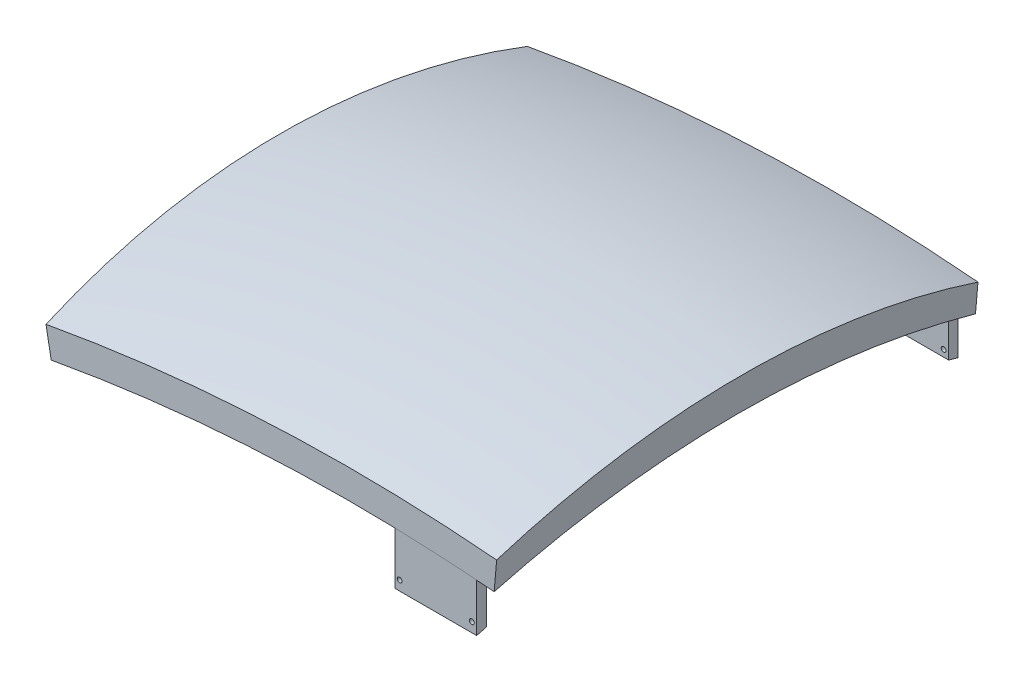
ISO-10303-21;
HEADER;
FILE_DESCRIPTION(('STEP AP214'),'2;1');
FILE_NAME('part.step','',(''),(''),'','','');
FILE_SCHEMA(('AUTOMOTIVE_DESIGN { 1 0 10303 214 1 1 1 1 }'));
ENDSEC;
DATA;
#1=APPLICATION_CONTEXT('core data for automotive mechanical design processes');
#2=APPLICATION_PROTOCOL_DEFINITION('international standard','automotive_design',2000,#1);
#3=PRODUCT_CONTEXT('',#1,'mechanical');
#4=PRODUCT('Part','Part','',(#3));
#5=PRODUCT_RELATED_PRODUCT_CATEGORY('part','',(#4));
#6=PRODUCT_DEFINITION_FORMATION('','',#4);
#7=PRODUCT_DEFINITION_CONTEXT('part definition',#1,'design');
#8=PRODUCT_DEFINITION('design','',#6,#7);
#9=PRODUCT_DEFINITION_SHAPE('','',#8);
#10=(LENGTH_UNIT() NAMED_UNIT(*) SI_UNIT(.MILLI.,.METRE.));
#11=(NAMED_UNIT(*) PLANE_ANGLE_UNIT() SI_UNIT($,.RADIAN.));
#12=(NAMED_UNIT(*) SI_UNIT($,.STERADIAN.) SOLID_ANGLE_UNIT());
#13=UNCERTAINTY_MEASURE_WITH_UNIT(LENGTH_MEASURE(1.E-05),#10,'distance_accuracy_value','');
#14=(GEOMETRIC_REPRESENTATION_CONTEXT(3) GLOBAL_UNCERTAINTY_ASSIGNED_CONTEXT((#13)) GLOBAL_UNIT_ASSIGNED_CONTEXT((#10,
#11,#12)) REPRESENTATION_CONTEXT('',''));
#15=CARTESIAN_POINT('',(0.,0.,0.));
#16=DIRECTION('',(0.,0.,1.));
#17=DIRECTION('',(1.,0.,0.));
#18=AXIS2_PLACEMENT_3D('',#15,#16,#17);
#19=CARTESIAN_POINT('',(-176.364898911844,394.628323453964,-1000.));
#20=CARTESIAN_POINT('',(-174.245064249706,418.997003403984,-919.073528480852));
#21=CARTESIAN_POINT('',(-172.640831351024,437.43855395933,-836.350074725818));
#22=CARTESIAN_POINT('',(-170.497967391497,462.071968532359,-669.083579056265));
#23=CARTESIAN_POINT('',(-169.959360397827,468.263555862461,-584.542116051659));
#24=CARTESIAN_POINT('',(-169.959360397827,468.263555862461,-415.457883948342));
#25=CARTESIAN_POINT('',(-170.497967390338,462.071968532186,-330.916420936693));
#26=CARTESIAN_POINT('',(-172.640831352182,437.438553959504,-163.649925281226));
#27=CARTESIAN_POINT('',(-174.245064251245,418.997003390395,-80.9264715179744));
#28=CARTESIAN_POINT('',(-176.364898911844,394.628323453964,0.));
#29=CARTESIAN_POINT('',(-176.364898911844,285.854271513005,-1000.));
#30=CARTESIAN_POINT('',(-174.245064255569,310.222951463068,-919.073528480711));
#31=CARTESIAN_POINT('',(-172.640831351024,328.664502018372,-836.350074725818));
#32=CARTESIAN_POINT('',(-170.497967391497,353.297916591401,-669.083579056265));
#33=CARTESIAN_POINT('',(-169.959360397827,359.489503921502,-584.542116051659));
#34=CARTESIAN_POINT('',(-169.959360397827,359.489503921502,-415.457883948342));
#35=CARTESIAN_POINT('',(-170.497967390338,353.297916591227,-330.916420936693));
#36=CARTESIAN_POINT('',(-172.640831352182,328.664502018545,-163.649925281226));
#37=CARTESIAN_POINT('',(-174.245064251245,310.222951449437,-80.9264715179745));
#38=CARTESIAN_POINT('',(-176.364898911844,285.854271513005,0.));
#39=B_SPLINE_SURFACE_WITH_KNOTS('',1,3,((#19,#20,#21,#22,#23,#24,#25,#26,#27,#28),(#29,#30,#31,
#32,#33,#34,#35,#36,#37,#38)),.UNSPECIFIED.,.F.,.F.,.F.,(2,2),(4,2,2,2,4),(0.,1.),(0.,0.25,0.5,
0.75,1.),.UNSPECIFIED.);
#40=CARTESIAN_POINT('',(-176.364898911844,285.854271513005,-1000.));
#41=CARTESIAN_POINT('',(-174.245064255569,310.222951463068,-919.073528480711));
#42=CARTESIAN_POINT('',(-172.640831351024,328.664502018372,-836.350074725818));
#43=CARTESIAN_POINT('',(-170.497967391497,353.297916591401,-669.083579056265));
#44=CARTESIAN_POINT('',(-169.959360397827,359.489503921502,-584.542116051659));
#45=CARTESIAN_POINT('',(-169.959360397827,359.489503921502,-415.457883948342));
#46=CARTESIAN_POINT('',(-170.497967390338,353.297916591227,-330.916420936693));
#47=CARTESIAN_POINT('',(-172.640831352182,328.664502018545,-163.649925281226));
#48=CARTESIAN_POINT('',(-174.245064251245,310.222951449437,-80.9264715179745));
#49=CARTESIAN_POINT('',(-176.364898911844,285.854271513005,0.));
#50=B_SPLINE_CURVE_WITH_KNOTS('',3,(#40,#41,#42,#43,#44,#45,#46,#47,#48,#49),.UNSPECIFIED.,.F.,
.F.,(4,2,2,2,4),(0.,0.25,0.5,0.75,1.),.UNSPECIFIED.);
#51=CARTESIAN_POINT('',(-176.364898911844,285.854271513005,-1000.));
#52=VERTEX_POINT('',#51);
#53=CARTESIAN_POINT('',(-175.852418351349,291.745520963929,-979.999999999994));
#54=VERTEX_POINT('',#53);
#55=EDGE_CURVE('E219',#52,#54,#50,.T.);
#56=DIRECTION('',(0.,-1.,0.));
#57=VECTOR('',#56,1.);
#58=CARTESIAN_POINT('',(-175.85241835074,346.132546934406,-980.000000000002));
#59=LINE('',#58,#57);
#60=CARTESIAN_POINT('',(-175.852418350196,394.615618463547,-980.000000000002));
#61=VERTEX_POINT('',#60);
#62=EDGE_CURVE('E220',#54,#61,#59,.F.);
#63=CARTESIAN_POINT('',(-175.852418350469,394.615618463553,-20.));
#64=CARTESIAN_POINT('',(-175.633649908094,397.130639264421,-28.7312953353162));
#65=CARTESIAN_POINT('',(-175.420856523349,399.576923444562,-37.4825373964243));
#66=CARTESIAN_POINT('',(-175.007270495764,404.331458464085,-55.0223803952738));
#67=CARTESIAN_POINT('',(-174.806477418497,406.639714300281,-63.8109799682703));
#68=CARTESIAN_POINT('',(-174.416931396696,411.117761702714,-81.4234274319611));
#69=CARTESIAN_POINT('',(-174.228178166723,413.287556551584,-90.2472744817342));
#70=CARTESIAN_POINT('',(-173.862751713488,417.488245043917,-107.92810932455));
#71=CARTESIAN_POINT('',(-173.686078348922,419.519140312178,-116.78509672865));
#72=CARTESIAN_POINT('',(-173.344849796396,423.441612147967,-134.530225449709));
#73=CARTESIAN_POINT('',(-173.180294770857,425.333186848197,-143.418367182555));
#74=CARTESIAN_POINT('',(-172.863346359201,428.976538350666,-161.223583009343));
#75=CARTESIAN_POINT('',(-172.710953119857,430.728313465744,-170.140657451107));
#76=CARTESIAN_POINT('',(-172.418369981168,434.091608591467,-188.001647931472));
#77=CARTESIAN_POINT('',(-172.278180376481,435.703125215566,-196.945564612788));
#78=CARTESIAN_POINT('',(-172.010045767962,438.785443326145,-214.858104223181));
#79=CARTESIAN_POINT('',(-171.882101211631,440.256239669947,-223.826728042874));
#80=CARTESIAN_POINT('',(-171.599913016004,443.500254976911,-244.631815034944));
#81=CARTESIAN_POINT('',(-171.450183189959,445.221616593362,-256.476464140352));
#82=CARTESIAN_POINT('',(-171.172102769806,448.418499365325,-280.19954475529));
#83=CARTESIAN_POINT('',(-171.043752976758,449.894011309434,-292.077977513662));
#84=CARTESIAN_POINT('',(-170.80846524885,452.598846602958,-315.86316896709));
#85=CARTESIAN_POINT('',(-170.701527503256,453.828167776245,-327.769927911585));
#86=CARTESIAN_POINT('',(-170.50910179039,456.040198549553,-351.606248608816));
#87=CARTESIAN_POINT('',(-170.423613376701,457.022913282118,-363.535809881765));
#88=CARTESIAN_POINT('',(-170.274086018133,458.741751258213,-387.41759736608));
#89=CARTESIAN_POINT('',(-170.21005562138,459.477776229178,-399.369830706989));
#90=CARTESIAN_POINT('',(-170.103524359393,460.702329772858,-423.286992414682));
#91=CARTESIAN_POINT('',(-170.061023407674,461.190859339774,-435.251920730276));
#92=CARTESIAN_POINT('',(-169.997582004924,461.920081638696,-459.189998295791));
#93=CARTESIAN_POINT('',(-169.97664248938,462.1607636173,-471.163147879859));
#94=CARTESIAN_POINT('',(-169.9614305314,462.335610929683,-489.125061834476));
#95=CARTESIAN_POINT('',(-169.959059728503,462.362860675007,-495.113042086699));
#96=CARTESIAN_POINT('',(-169.959721965668,462.355248912441,-507.088968680493));
#97=CARTESIAN_POINT('',(-169.962755024179,462.320387192501,-513.076915021877));
#98=CARTESIAN_POINT('',(-169.983385295761,462.083261072045,-534.62341455575));
#99=CARTESIAN_POINT('',(-170.016513112895,461.702483600511,-550.180403000621));
#100=CARTESIAN_POINT('',(-170.119165491115,460.522540372856,-581.280495529891));
#101=CARTESIAN_POINT('',(-170.188695570766,459.723311179656,-596.823597151074));
#102=CARTESIAN_POINT('',(-170.364092875445,457.707116426226,-627.884272853659));
#103=CARTESIAN_POINT('',(-170.469964245387,456.490103215563,-643.401843820218));
#104=CARTESIAN_POINT('',(-170.717982682389,453.6390081718,-674.39972826961));
#105=CARTESIAN_POINT('',(-170.860132534649,452.004894316728,-689.880038799706));
#106=CARTESIAN_POINT('',(-171.100504138609,449.241596321608,-713.062938336732));
#107=CARTESIAN_POINT('',(-171.185155617635,448.268439688238,-720.78455671707));
#108=CARTESIAN_POINT('',(-171.363499099536,446.218157125475,-736.213872974977));
#109=CARTESIAN_POINT('',(-171.457191102378,445.141031196451,-743.921570852596));
#110=CARTESIAN_POINT('',(-171.752166931321,441.74993242435,-767.049160336694));
#111=CARTESIAN_POINT('',(-171.96706747798,439.279493515605,-782.446233800843));
#112=CARTESIAN_POINT('',(-172.432902272435,433.92453755953,-813.166889478322));
#113=CARTESIAN_POINT('',(-172.683835274314,431.040034829533,-828.490474213792));
#114=CARTESIAN_POINT('',(-173.221509234822,424.859423134112,-859.052773873231));
#115=CARTESIAN_POINT('',(-173.5082478141,421.563341518912,-874.291494366374));
#116=CARTESIAN_POINT('',(-174.117298923732,414.562161821589,-904.672367575334));
#117=CARTESIAN_POINT('',(-174.439607923776,410.85710432971,-919.81452971692));
#118=CARTESIAN_POINT('',(-175.119561471268,403.040603507002,-949.990672281036));
#119=CARTESIAN_POINT('',(-175.477201368815,398.929213653578,-965.024666660867));
#120=CARTESIAN_POINT('',(-175.852418350196,394.615618463546,-980.000000000002));
#121=B_SPLINE_CURVE_WITH_KNOTS('',3,(#63,#64,#65,#66,#67,#68,#69,#70,#71,#72,#73,#74,#75,#76,
#77,#78,#79,#80,#81,#82,#83,#84,#85,#86,#87,#88,#89,#90,#91,#92,#93,#94,#95,#96,#97,#98,#99,
#100,#101,#102,#103,#104,#105,#106,#107,#108,#109,#110,#111,#112,#113,#114,#115,#116,#117,#118,
#119,#120),.UNSPECIFIED.,.F.,.F.,(4,2,2,2,2,2,2,2,2,2,2,2,2,2,2,2,2,2,2,2,2,2,2,2,2,2,2,2,4),
(0.,27.2665127558033,54.5320378283226,81.7969162494932,109.061475681148,136.32640047032,
163.591654254512,190.857566176607,218.124474161715,254.03180869546,289.940488289235,
325.849485272641,361.75773483106,397.680272024188,433.602664913344,469.526616307095,
487.490455774942,505.454356571986,552.133113364645,598.818948684264,645.510110535511,
692.20485807516,715.553724726998,738.902591296155,785.682823121186,832.461437787549,
879.236945575881,926.007815132002,972.772537350092),.UNSPECIFIED.);
#122=CARTESIAN_POINT('',(-175.852418350469,394.615618463554,-20.));
#123=VERTEX_POINT('',#122);
#124=EDGE_CURVE('E126',#123,#61,#121,.T.);
#125=DIRECTION('',(0.,-1.,0.));
#126=VECTOR('',#125,1.);
#127=CARTESIAN_POINT('',(-175.852418350469,346.132546931618,-20.));
#128=LINE('',#127,#126);
#129=CARTESIAN_POINT('',(-175.852418350469,291.745520961139,-19.9999999999999));
#130=VERTEX_POINT('',#129);
#131=EDGE_CURVE('E125',#130,#123,#128,.F.);
#132=CARTESIAN_POINT('',(-176.364898911844,285.854271513005,0.));
#133=VERTEX_POINT('',#132);
#134=EDGE_CURVE('E226',#130,#133,#50,.T.);
#135=DIRECTION('',(0.,-1.,0.));
#136=VECTOR('',#135,1.);
#137=CARTESIAN_POINT('',(-176.364898911844,285.854271513005,0.));
#138=LINE('',#137,#136);
#139=CARTESIAN_POINT('',(-176.364898911844,394.628323453964,0.));
#140=VERTEX_POINT('',#139);
#141=EDGE_CURVE('E229',#140,#133,#138,.T.);
#142=CARTESIAN_POINT('',(-176.364898911844,394.628323453964,-1000.));
#143=CARTESIAN_POINT('',(-174.245064249706,418.997003403984,-919.073528480852));
#144=CARTESIAN_POINT('',(-172.640831351024,437.43855395933,-836.350074725818));
#145=CARTESIAN_POINT('',(-170.497967391497,462.071968532359,-669.083579056265));
#146=CARTESIAN_POINT('',(-169.959360397827,468.263555862461,-584.542116051659));
#147=CARTESIAN_POINT('',(-169.959360397827,468.263555862461,-415.457883948342));
#148=CARTESIAN_POINT('',(-170.497967390339,462.071968532186,-330.916420936693));
#149=CARTESIAN_POINT('',(-172.640831352182,437.438553959504,-163.649925281226));
#150=CARTESIAN_POINT('',(-174.245064251245,418.997003390395,-80.9264715179744));
#151=CARTESIAN_POINT('',(-176.364898911844,394.628323453964,0.));
#152=B_SPLINE_CURVE_WITH_KNOTS('',3,(#142,#143,#144,#145,#146,#147,#148,#149,#150,#151),
.UNSPECIFIED.,.F.,.F.,(4,2,2,2,4),(0.,0.25,0.5,0.75,1.),.UNSPECIFIED.);
#153=CARTESIAN_POINT('',(-176.364898911844,394.628323453964,-1000.));
#154=VERTEX_POINT('',#153);
#155=EDGE_CURVE('E253',#154,#140,#152,.T.);
#156=DIRECTION('',(0.,-1.,0.));
#157=VECTOR('',#156,1.);
#158=CARTESIAN_POINT('',(-176.364898911844,285.854271513005,-1000.));
#159=LINE('',#158,#157);
#160=EDGE_CURVE('E222',#154,#52,#159,.T.);
#161=ORIENTED_EDGE('',*,*,#55,.T.);
#162=ORIENTED_EDGE('',*,*,#62,.T.);
#163=ORIENTED_EDGE('',*,*,#124,.F.);
#164=ORIENTED_EDGE('',*,*,#131,.F.);
#165=ORIENTED_EDGE('',*,*,#134,.T.);
#166=ORIENTED_EDGE('',*,*,#141,.F.);
#167=ORIENTED_EDGE('',*,*,#155,.F.);
#168=ORIENTED_EDGE('',*,*,#160,.T.);
#169=EDGE_LOOP('',(#161,#162,#163,#164,#165,#166,#167,#168));
#170=FACE_BOUND('',#169,.T.);
#171=ADVANCED_FACE('F45',(#170),#39,.T.);
#172=CARTESIAN_POINT('',(-176.364898911844,285.854271513005,-1000.));
#173=CARTESIAN_POINT('',(-174.245064255569,310.222951463068,-919.073528480711));
#174=CARTESIAN_POINT('',(-172.640831351024,328.664502018372,-836.350074725818));
#175=CARTESIAN_POINT('',(-170.497967391497,353.297916591401,-669.083579056265));
#176=CARTESIAN_POINT('',(-169.959360397827,359.489503921502,-584.542116051659));
#177=CARTESIAN_POINT('',(-169.959360397827,359.489503921502,-415.457883948342));
#178=CARTESIAN_POINT('',(-170.497967390338,353.297916591227,-330.916420936693));
#179=CARTESIAN_POINT('',(-172.640831352182,328.664502018545,-163.649925281226));
#180=CARTESIAN_POINT('',(-174.245064251245,310.222951449437,-80.9264715179745));
#181=CARTESIAN_POINT('',(-176.364898911844,285.854271513005,0.));
#182=CARTESIAN_POINT('',(-6.36489891184411,285.854271513005,-1000.));
#183=CARTESIAN_POINT('',(-4.24506425263745,310.222951463047,-919.073528480782));
#184=CARTESIAN_POINT('',(-2.64083135102365,328.664502018372,-836.350074725818));
#185=CARTESIAN_POINT('',(-0.497967391496575,353.297916591401,-669.083579056265));
#186=CARTESIAN_POINT('',(0.0406396021734529,359.489503921502,-584.542116051659));
#187=CARTESIAN_POINT('',(0.0406396021734529,359.489503921502,-415.457883948342));
#188=CARTESIAN_POINT('',(-0.497967390338402,353.297916591227,-330.916420936693));
#189=CARTESIAN_POINT('',(-2.64083135218182,328.664502018545,-163.649925281226));
#190=CARTESIAN_POINT('',(-4.24506425124502,310.222951449437,-80.9264715179744));
#191=CARTESIAN_POINT('',(-6.36489891184411,285.854271513005,0.));
#192=B_SPLINE_SURFACE_WITH_KNOTS('',1,3,((#172,#173,#174,#175,#176,#177,#178,#179,#180,#181),
(#182,#183,#184,#185,#186,#187,#188,#189,#190,#191)),.UNSPECIFIED.,.F.,.F.,.F.,(2,2),(4,2,2,2,
4),(0.,1.),(0.,0.25,0.5,0.75,1.),.UNSPECIFIED.);
#193=CARTESIAN_POINT('',(-6.36489891184411,285.854271513005,-1000.));
#194=CARTESIAN_POINT('',(-4.24506425263745,310.222951463047,-919.073528480782));
#195=CARTESIAN_POINT('',(-2.64083135102365,328.664502018372,-836.350074725818));
#196=CARTESIAN_POINT('',(-0.497967391496575,353.297916591401,-669.083579056265));
#197=CARTESIAN_POINT('',(0.0406396021734529,359.489503921502,-584.542116051659));
#198=CARTESIAN_POINT('',(0.0406396021734529,359.489503921502,-415.457883948342));
#199=CARTESIAN_POINT('',(-0.497967390338402,353.297916591227,-330.916420936693));
#200=CARTESIAN_POINT('',(-2.64083135218182,328.664502018545,-163.649925281226));
#201=CARTESIAN_POINT('',(-4.24506425124502,310.222951449437,-80.9264715179744));
#202=CARTESIAN_POINT('',(-6.36489891184411,285.854271513005,0.));
#203=B_SPLINE_CURVE_WITH_KNOTS('',3,(#193,#194,#195,#196,#197,#198,#199,#200,#201,#202),
.UNSPECIFIED.,.F.,.F.,(4,2,2,2,4),(0.,0.25,0.5,0.75,1.),.UNSPECIFIED.);
#204=CARTESIAN_POINT('',(-6.36489891184411,285.854271513005,-1000.));
#205=VERTEX_POINT('',#204);
#206=CARTESIAN_POINT('',(-5.85241835073964,291.745520963927,-980.000000000002));
#207=VERTEX_POINT('',#206);
#208=EDGE_CURVE('E241',#205,#207,#203,.T.);
#209=DIRECTION('',(1.,0.,0.));
#210=VECTOR('',#209,1.);
#211=CARTESIAN_POINT('',(-90.8524183510444,291.745520963927,-980.000000000002));
#212=LINE('',#211,#210);
#213=EDGE_CURVE('E276',#207,#54,#212,.F.);
#214=DIRECTION('',(1.,0.,0.));
#215=VECTOR('',#214,1.);
#216=CARTESIAN_POINT('',(-6.36489891184411,285.854271513005,-1000.));
#217=LINE('',#216,#215);
#218=EDGE_CURVE('E235',#52,#205,#217,.T.);
#219=ORIENTED_EDGE('',*,*,#208,.T.);
#220=ORIENTED_EDGE('',*,*,#213,.T.);
#221=ORIENTED_EDGE('',*,*,#55,.F.);
#222=ORIENTED_EDGE('',*,*,#218,.T.);
#223=EDGE_LOOP('',(#219,#220,#221,#222));
#224=FACE_BOUND('',#223,.T.);
#225=ADVANCED_FACE('F206',(#224),#192,.T.);
#226=CARTESIAN_POINT('',(-6.36489891184411,285.854271513005,-1000.));
#227=CARTESIAN_POINT('',(-4.24506425263745,310.222951463047,-919.073528480782));
#228=CARTESIAN_POINT('',(-2.64083135102365,328.664502018372,-836.350074725818));
#229=CARTESIAN_POINT('',(-0.497967391496575,353.297916591401,-669.083579056265));
#230=CARTESIAN_POINT('',(0.0406396021734529,359.489503921502,-584.542116051659));
#231=CARTESIAN_POINT('',(0.0406396021734529,359.489503921502,-415.457883948342));
#232=CARTESIAN_POINT('',(-0.497967390338402,353.297916591227,-330.916420936693));
#233=CARTESIAN_POINT('',(-2.64083135218182,328.664502018545,-163.649925281226));
#234=CARTESIAN_POINT('',(-4.24506425124502,310.222951449437,-80.9264715179744));
#235=CARTESIAN_POINT('',(-6.36489891184411,285.854271513005,0.));
#236=CARTESIAN_POINT('',(-6.36489891184412,385.854271513005,-1000.));
#237=CARTESIAN_POINT('',(-4.24506425263746,410.222951463047,-919.073528480782));
#238=CARTESIAN_POINT('',(-2.64083135102365,428.664502018372,-836.350074725818));
#239=CARTESIAN_POINT('',(-0.497967391496583,453.297916591401,-669.083579056265));
#240=CARTESIAN_POINT('',(0.0406396021734451,459.489503921502,-584.542116051659));
#241=CARTESIAN_POINT('',(0.0406396021734451,459.489503921502,-415.457883948342));
#242=CARTESIAN_POINT('',(-0.49796739033841,453.297916591227,-330.916420936693));
#243=CARTESIAN_POINT('',(-2.64083135218183,428.664502018545,-163.649925281226));
#244=CARTESIAN_POINT('',(-4.24506425124503,410.222951449437,-80.9264715179743));
#245=CARTESIAN_POINT('',(-6.36489891184412,385.854271513005,0.));
#246=B_SPLINE_SURFACE_WITH_KNOTS('',1,3,((#226,#227,#228,#229,#230,#231,#232,#233,#234,#235),
(#236,#237,#238,#239,#240,#241,#242,#243,#244,#245)),.UNSPECIFIED.,.F.,.F.,.F.,(2,2),(4,2,2,2,
4),(0.,1.),(0.,0.25,0.5,0.75,1.),.UNSPECIFIED.);
#247=CARTESIAN_POINT('',(-5.85241835073964,386.190688597875,-980.000000000002));
#248=CARTESIAN_POINT('',(-5.584374190925,389.272197081319,-969.302055555598));
#249=CARTESIAN_POINT('',(-5.32529993055781,392.250516221305,-958.574168081613));
#250=CARTESIAN_POINT('',(-4.82518274419966,397.999763906403,-937.063110535628));
#251=CARTESIAN_POINT('',(-4.58413893294944,400.770702633485,-926.279943205572));
#252=CARTESIAN_POINT('',(-4.12015343214998,406.104416108031,-904.662138592607));
#253=CARTESIAN_POINT('',(-3.89721130535257,408.667195883599,-893.827502559627));
#254=CARTESIAN_POINT('',(-3.4694869855976,413.583965659277,-872.109827550562));
#255=CARTESIAN_POINT('',(-3.26470602998555,415.937941433287,-861.226785329465));
#256=CARTESIAN_POINT('',(-2.87339505896537,420.436097709195,-839.416819363378));
#257=CARTESIAN_POINT('',(-2.68686549579469,422.580273012607,-828.489894538034));
#258=CARTESIAN_POINT('',(-2.33213292928621,426.657989574864,-806.595967758848));
#259=CARTESIAN_POINT('',(-2.16393083485955,428.591520387251,-795.628963845221));
#260=CARTESIAN_POINT('',(-1.8340853738682,432.383291419265,-772.840199982705));
#261=CARTESIAN_POINT('',(-1.67386669937256,434.225162143922,-761.015692058496));
#262=CARTESIAN_POINT('',(-1.37478199539621,437.663492244968,-737.330224098406));
#263=CARTESIAN_POINT('',(-1.23591697326068,439.259940043682,-725.469262369744));
#264=CARTESIAN_POINT('',(-0.979576358574924,442.206862899885,-701.716433170604));
#265=CARTESIAN_POINT('',(-0.862101043539779,443.557334766026,-689.824565301171));
#266=CARTESIAN_POINT('',(-0.648578348670482,446.011919132122,-666.015507512087));
#267=CARTESIAN_POINT('',(-0.552530495598842,447.116037072942,-654.098318157544));
#268=CARTESIAN_POINT('',(-0.381853219075361,449.078027992932,-630.238089647275));
#269=CARTESIAN_POINT('',(-0.307233529985813,449.935789057405,-618.295041218636));
#270=CARTESIAN_POINT('',(-0.179504042837218,451.404033483393,-594.393712943188));
#271=CARTESIAN_POINT('',(-0.126394121382136,452.014518263469,-582.435433184154));
#272=CARTESIAN_POINT('',(-0.0417143269575638,452.987878263807,-558.508145463721));
#273=CARTESIAN_POINT('',(-0.0101454600220898,453.350741919394,-546.539137027397));
#274=CARTESIAN_POINT('',(0.0314170400820982,453.82847123542,-522.595003528362));
#275=CARTESIAN_POINT('',(0.0414085143254668,453.943312079944,-510.619877973492));
#276=CARTESIAN_POINT('',(0.0394944453292095,453.921311455744,-482.497324246591));
#277=CARTESIAN_POINT('',(0.0187469637600509,453.682841587524,-466.349870014478));
#278=CARTESIAN_POINT('',(-0.0619697266926949,452.755053137605,-434.065365764717));
#279=CARTESIAN_POINT('',(-0.121945693756281,452.065656871495,-417.928318019452));
#280=CARTESIAN_POINT('',(-0.281055727676614,450.236705600239,-385.677807093863));
#281=CARTESIAN_POINT('',(-0.380194887449697,449.097092047287,-369.564347254645));
#282=CARTESIAN_POINT('',(-0.617561861057546,446.368478402231,-337.374395326541));
#283=CARTESIAN_POINT('',(-0.755793100405274,444.779438928382,-321.297906601826));
#284=CARTESIAN_POINT('',(-1.07126362003529,441.15281368142,-289.195218979525));
#285=CARTESIAN_POINT('',(-1.24850471564346,439.115207034208,-273.169022457502));
#286=CARTESIAN_POINT('',(-1.64231604181555,434.587893262455,-241.148519272944));
#287=CARTESIAN_POINT('',(-1.85896393668431,432.097293363551,-225.15433978741));
#288=CARTESIAN_POINT('',(-2.33112824371179,426.669505828735,-193.243173501729));
#289=CARTESIAN_POINT('',(-2.58664311904755,423.732335850464,-177.326183675123));
#290=CARTESIAN_POINT('',(-3.13627809428846,417.414235401886,-145.582441094703));
#291=CARTESIAN_POINT('',(-3.43039528436727,414.033338379538,-129.755681633096));
#292=CARTESIAN_POINT('',(-4.05697466069022,406.830679174053,-98.2054324886746));
#293=CARTESIAN_POINT('',(-4.38943253430045,403.008966574692,-82.4819314010383));
#294=CARTESIAN_POINT('',(-5.09242445775228,394.927639867171,-51.1512290309942));
#295=CARTESIAN_POINT('',(-5.46295282414653,390.668091122418,-35.5440107610516));
#296=CARTESIAN_POINT('',(-5.85241835046867,386.190688597856,-20.0000000000001));
#297=B_SPLINE_CURVE_WITH_KNOTS('',3,(#247,#248,#249,#250,#251,#252,#253,#254,#255,#256,#257,
#258,#259,#260,#261,#262,#263,#264,#265,#266,#267,#268,#269,#270,#271,#272,#273,#274,#275,#276,
#277,#278,#279,#280,#281,#282,#283,#284,#285,#286,#287,#288,#289,#290,#291,#292,#293,#294,#295,
#296),.UNSPECIFIED.,.F.,.F.,(4,2,2,2,2,2,2,2,2,2,2,2,2,2,2,2,2,2,2,2,2,2,2,2,4),(0.,
33.407883505193,66.8141256715095,100.219560666183,133.627269873331,167.035806655328,
200.445999508021,236.347895432942,272.251484488092,308.155539331667,344.058801135578,
379.978347324266,415.897687448786,451.818705003029,487.743316467066,536.1843447878,
584.63372059998,633.089399010907,681.549324753124,730.011506057732,778.570254106474,
827.127082613014,875.680253026053,924.227967401969,972.768444714255),.UNSPECIFIED.);
#298=CARTESIAN_POINT('',(-5.85241835073964,386.190688597875,-980.000000000002));
#299=VERTEX_POINT('',#298);
#300=CARTESIAN_POINT('',(-5.8524183504684,386.190688597856,-20.));
#301=VERTEX_POINT('',#300);
#302=EDGE_CURVE('E113',#299,#301,#297,.T.);
#303=DIRECTION('',(0.,1.,0.));
#304=VECTOR('',#303,1.);
#305=CARTESIAN_POINT('',(-5.85241835073965,341.745520963927,-980.000000000002));
#306=LINE('',#305,#304);
#307=EDGE_CURVE('E12',#299,#207,#306,.F.);
#308=DIRECTION('',(0.,1.,0.));
#309=VECTOR('',#308,1.);
#310=CARTESIAN_POINT('',(-6.36489891184412,385.854271513005,-1000.));
#311=LINE('',#310,#309);
#312=CARTESIAN_POINT('',(-6.36489891184398,385.854271513005,-1000.));
#313=VERTEX_POINT('',#312);
#314=EDGE_CURVE('E239',#205,#313,#311,.T.);
#315=CARTESIAN_POINT('',(-6.36489891184383,385.854271513006,-1000.));
#316=CARTESIAN_POINT('',(-4.24506425263716,410.222951463047,-919.073528480782));
#317=CARTESIAN_POINT('',(-2.64083135102336,428.664502018372,-836.350074725818));
#318=CARTESIAN_POINT('',(-0.497967391496292,453.297916591401,-669.083579056265));
#319=CARTESIAN_POINT('',(0.0406396021737365,459.489503921502,-584.542116051659));
#320=CARTESIAN_POINT('',(0.0406396021737365,459.489503921502,-415.457883948342));
#321=CARTESIAN_POINT('',(-0.497967390338119,453.297916591227,-330.916420936693));
#322=CARTESIAN_POINT('',(-2.64083135218154,428.664502018545,-163.649925281226));
#323=CARTESIAN_POINT('',(-4.24506425124473,410.222951449437,-80.9264715179743));
#324=CARTESIAN_POINT('',(-6.36489891184383,385.854271513006,0.));
#325=B_SPLINE_CURVE_WITH_KNOTS('',3,(#315,#316,#317,#318,#319,#320,#321,#322,#323,#324),
.UNSPECIFIED.,.F.,.F.,(4,2,2,2,4),(0.,0.25,0.5,0.75,1.),.UNSPECIFIED.);
#326=CARTESIAN_POINT('',(-6.36489891184398,385.854271513005,0.));
#327=VERTEX_POINT('',#326);
#328=EDGE_CURVE('E251',#313,#327,#325,.T.);
#329=DIRECTION('',(0.,1.,0.));
#330=VECTOR('',#329,1.);
#331=CARTESIAN_POINT('',(-6.36489891184412,385.854271513005,0.));
#332=LINE('',#331,#330);
#333=CARTESIAN_POINT('',(-6.36489891184411,285.854271513005,0.));
#334=VERTEX_POINT('',#333);
#335=EDGE_CURVE('E120',#334,#327,#332,.T.);
#336=CARTESIAN_POINT('',(-5.85241835046867,291.745520961139,-20.));
#337=VERTEX_POINT('',#336);
#338=EDGE_CURVE('E70',#337,#334,#203,.T.);
#339=DIRECTION('',(0.,1.,0.));
#340=VECTOR('',#339,1.);
#341=CARTESIAN_POINT('',(-5.85241835046867,341.745520961139,-20.));
#342=LINE('',#341,#340);
#343=EDGE_CURVE('E54',#301,#337,#342,.F.);
#344=ORIENTED_EDGE('',*,*,#302,.F.);
#345=ORIENTED_EDGE('',*,*,#307,.T.);
#346=ORIENTED_EDGE('',*,*,#208,.F.);
#347=ORIENTED_EDGE('',*,*,#314,.T.);
#348=ORIENTED_EDGE('',*,*,#328,.T.);
#349=ORIENTED_EDGE('',*,*,#335,.F.);
#350=ORIENTED_EDGE('',*,*,#338,.F.);
#351=ORIENTED_EDGE('',*,*,#343,.F.);
#352=EDGE_LOOP('',(#344,#345,#346,#347,#348,#349,#350,#351));
#353=FACE_BOUND('',#352,.T.);
#354=ADVANCED_FACE('F128',(#353),#246,.T.);
#355=CARTESIAN_POINT('',(-269.22853641592,-3055.92229707452,-1000.));
#356=DIRECTION('',(0.,0.,1.));
#357=DIRECTION('',(1.,0.,0.));
#358=AXIS2_PLACEMENT_3D('',#355,#356,#357);
#359=PLANE('',#358);
#360=CARTESIAN_POINT('',(-16.3648989118442,305.854271513005,-1000.));
#361=DIRECTION('',(0.,0.,1.));
#362=DIRECTION('',(1.,0.,0.));
#363=AXIS2_PLACEMENT_3D('',#360,#361,#362);
#364=CIRCLE('',#363,4.99999999999988);
#365=CARTESIAN_POINT('',(-11.3648989118443,305.854271513005,-1000.));
#366=VERTEX_POINT('',#365);
#367=EDGE_CURVE('E289',#366,#366,#364,.T.);
#368=ORIENTED_EDGE('',*,*,#367,.T.);
#369=EDGE_LOOP('',(#368));
#370=FACE_BOUND('',#369,.T.);
#371=CARTESIAN_POINT('',(-166.364898911844,305.854271513005,-1000.));
#372=DIRECTION('',(0.,0.,1.));
#373=DIRECTION('',(1.,0.,0.));
#374=AXIS2_PLACEMENT_3D('',#371,#372,#373);
#375=CIRCLE('',#374,4.99999999999987);
#376=CARTESIAN_POINT('',(-161.364898911844,305.854271513005,-1000.));
#377=VERTEX_POINT('',#376);
#378=EDGE_CURVE('E141',#377,#377,#375,.T.);
#379=ORIENTED_EDGE('',*,*,#378,.T.);
#380=EDGE_LOOP('',(#379));
#381=FACE_BOUND('',#380,.T.);
#382=CARTESIAN_POINT('',(-269.22853641592,-3055.92229707452,-1000.));
#383=DIRECTION('',(0.,0.,1.));
#384=DIRECTION('',(1.,0.,0.));
#385=AXIS2_PLACEMENT_3D('',#382,#383,#384);
#386=CIRCLE('',#385,3451.8);
#387=EDGE_CURVE('E273',#313,#154,#386,.T.);
#388=ORIENTED_EDGE('',*,*,#387,.F.);
#389=ORIENTED_EDGE('',*,*,#314,.F.);
#390=ORIENTED_EDGE('',*,*,#218,.F.);
#391=ORIENTED_EDGE('',*,*,#160,.F.);
#392=EDGE_LOOP('',(#388,#389,#390,#391));
#393=FACE_BOUND('',#392,.T.);
#394=ADVANCED_FACE('F47',(#370,#381,#393),#359,.F.);
#395=CARTESIAN_POINT('',(-269.22853641592,-3055.92229707452,0.));
#396=DIRECTION('',(0.,0.,1.));
#397=DIRECTION('',(1.,0.,0.));
#398=AXIS2_PLACEMENT_3D('',#395,#396,#397);
#399=PLANE('',#398);
#400=CARTESIAN_POINT('',(-16.3648989118442,305.854271513005,0.));
#401=DIRECTION('',(0.,0.,1.));
#402=DIRECTION('',(1.,0.,0.));
#403=AXIS2_PLACEMENT_3D('',#400,#401,#402);
#404=CIRCLE('',#403,5.025);
#405=CARTESIAN_POINT('',(-11.3398989118442,305.854271513005,0.));
#406=VERTEX_POINT('',#405);
#407=EDGE_CURVE('E296',#406,#406,#404,.T.);
#408=ORIENTED_EDGE('',*,*,#407,.F.);
#409=EDGE_LOOP('',(#408));
#410=FACE_BOUND('',#409,.T.);
#411=CARTESIAN_POINT('',(-166.364898911844,305.854271513005,0.));
#412=DIRECTION('',(0.,0.,1.));
#413=DIRECTION('',(1.,0.,0.));
#414=AXIS2_PLACEMENT_3D('',#411,#412,#413);
#415=CIRCLE('',#414,5.025);
#416=CARTESIAN_POINT('',(-161.339898911844,305.854271513005,0.));
#417=VERTEX_POINT('',#416);
#418=EDGE_CURVE('E152',#417,#417,#415,.T.);
#419=ORIENTED_EDGE('',*,*,#418,.F.);
#420=EDGE_LOOP('',(#419));
#421=FACE_BOUND('',#420,.T.);
#422=CARTESIAN_POINT('',(-269.22853641592,-3055.92229707452,0.));
#423=DIRECTION('',(0.,0.,1.));
#424=DIRECTION('',(1.,0.,0.));
#425=AXIS2_PLACEMENT_3D('',#422,#423,#424);
#426=CIRCLE('',#425,3451.8);
#427=EDGE_CURVE('E256',#327,#140,#426,.T.);
#428=ORIENTED_EDGE('',*,*,#427,.T.);
#429=ORIENTED_EDGE('',*,*,#141,.T.);
#430=DIRECTION('',(1.,0.,0.));
#431=VECTOR('',#430,1.);
#432=CARTESIAN_POINT('',(-6.36489891184411,285.854271513005,0.));
#433=LINE('',#432,#431);
#434=EDGE_CURVE('E225',#133,#334,#433,.T.);
#435=ORIENTED_EDGE('',*,*,#434,.T.);
#436=ORIENTED_EDGE('',*,*,#335,.T.);
#437=EDGE_LOOP('',(#428,#429,#435,#436));
#438=FACE_BOUND('',#437,.T.);
#439=ADVANCED_FACE('F195',(#410,#421,#438),#399,.T.);
#440=CARTESIAN_POINT('',(-6.36489891184383,385.854271513006,-1000.));
#441=CARTESIAN_POINT('',(-4.24506425263716,410.222951463047,-919.073528480782));
#442=CARTESIAN_POINT('',(-2.64083135102336,428.664502018372,-836.350074725818));
#443=CARTESIAN_POINT('',(-0.497967391496292,453.297916591401,-669.083579056265));
#444=CARTESIAN_POINT('',(0.0406396021737365,459.489503921502,-584.542116051659));
#445=CARTESIAN_POINT('',(0.0406396021737365,459.489503921502,-415.457883948342));
#446=CARTESIAN_POINT('',(-0.497967390338119,453.297916591227,-330.916420936693));
#447=CARTESIAN_POINT('',(-2.64083135218154,428.664502018545,-163.649925281226));
#448=CARTESIAN_POINT('',(-4.24506425124473,410.222951449437,-80.9264715179743));
#449=CARTESIAN_POINT('',(-6.36489891184383,385.854271513006,0.));
#450=CARTESIAN_POINT('',(-62.9536910044757,390.176206837685,-1000.));
#451=CARTESIAN_POINT('',(-60.833856345269,414.544886787726,-919.073528480782));
#452=CARTESIAN_POINT('',(-59.2296234436552,432.986437343051,-836.350074725818));
#453=CARTESIAN_POINT('',(-57.0867594841281,457.61985191608,-669.083579056265));
#454=CARTESIAN_POINT('',(-56.5481524904581,463.811439246181,-584.542116051659));
#455=CARTESIAN_POINT('',(-56.5481524904581,463.811439246181,-415.457883948342));
#456=CARTESIAN_POINT('',(-57.0867594829699,457.619851915906,-330.916420936693));
#457=CARTESIAN_POINT('',(-59.2296234448134,432.986437343224,-163.649925281226));
#458=CARTESIAN_POINT('',(-60.8338563438765,414.544886774116,-80.9264715179744));
#459=CARTESIAN_POINT('',(-62.9536910044757,390.176206837685,0.));
#460=CARTESIAN_POINT('',(-119.631846147085,393.101483762031,-1000.));
#461=CARTESIAN_POINT('',(-117.512011487878,417.470163712073,-919.073528480782));
#462=CARTESIAN_POINT('',(-115.907778586265,435.911714267398,-836.350074725818));
#463=CARTESIAN_POINT('',(-113.764914626738,460.545128840426,-669.083579056265));
#464=CARTESIAN_POINT('',(-113.226307633068,466.736716170528,-584.542116051659));
#465=CARTESIAN_POINT('',(-113.226307633068,466.736716170528,-415.457883948342));
#466=CARTESIAN_POINT('',(-113.764914625579,460.545128840253,-330.916420936693));
#467=CARTESIAN_POINT('',(-115.907778587423,435.911714267571,-163.649925281226));
#468=CARTESIAN_POINT('',(-117.512011486486,417.470163698462,-80.9264715179744));
#469=CARTESIAN_POINT('',(-119.631846147085,393.101483762031,0.));
#470=CARTESIAN_POINT('',(-176.364898911844,394.628323453964,-1000.));
#471=CARTESIAN_POINT('',(-174.245064249706,418.997003403984,-919.073528480852));
#472=CARTESIAN_POINT('',(-172.640831351024,437.43855395933,-836.350074725818));
#473=CARTESIAN_POINT('',(-170.497967391497,462.071968532359,-669.083579056265));
#474=CARTESIAN_POINT('',(-169.959360397827,468.263555862461,-584.542116051659));
#475=CARTESIAN_POINT('',(-169.959360397827,468.263555862461,-415.457883948342));
#476=CARTESIAN_POINT('',(-170.497967390339,462.071968532186,-330.916420936693));
#477=CARTESIAN_POINT('',(-172.640831352182,437.438553959504,-163.649925281226));
#478=CARTESIAN_POINT('',(-174.245064251245,418.997003390395,-80.9264715179744));
#479=CARTESIAN_POINT('',(-176.364898911844,394.628323453964,0.));
#480=(BOUNDED_SURFACE() B_SPLINE_SURFACE(3,3,((#440,#441,#442,#443,#444,#445,#446,#447,#448,
#449),(#450,#451,#452,#453,#454,#455,#456,#457,#458,#459),(#460,#461,#462,#463,#464,#465,#466,
#467,#468,#469),(#470,#471,#472,#473,#474,#475,#476,#477,#478,#479)),.UNSPECIFIED.,.F.,.F.,
.F.) B_SPLINE_SURFACE_WITH_KNOTS((4,4),(4,2,2,2,4),(0.,1.),(0.,0.25,0.5,0.75,1.),
.UNSPECIFIED.) GEOMETRIC_REPRESENTATION_ITEM() RATIONAL_B_SPLINE_SURFACE(((1.,1.,1.,1.,1.,1.,1.,
1.,1.,1.),(0.999797303283537,0.999797303283537,0.999797303283537,0.999797303283537,
0.999797303283537,0.999797303283537,0.999797303283537,0.999797303283537,0.999797303283537,
0.999797303283537),(0.999797303283537,0.999797303283537,0.999797303283537,0.999797303283537,
0.999797303283537,0.999797303283537,0.999797303283537,0.999797303283537,0.999797303283537,
0.999797303283537),(1.,1.,1.,1.,1.,1.,1.,1.,1.,1.))) REPRESENTATION_ITEM('') SURFACE());
#481=ORIENTED_EDGE('',*,*,#155,.T.);
#482=ORIENTED_EDGE('',*,*,#427,.F.);
#483=ORIENTED_EDGE('',*,*,#328,.F.);
#484=ORIENTED_EDGE('',*,*,#387,.T.);
#485=EDGE_LOOP('',(#481,#482,#483,#484));
#486=FACE_BOUND('',#485,.T.);
#487=ADVANCED_FACE('F191',(#486),#480,.T.);
#488=DIRECTION('',(1.,0.,0.));
#489=VECTOR('',#488,1.);
#490=CARTESIAN_POINT('',(-90.8524183504687,291.745520961139,-19.9999999999999));
#491=LINE('',#490,#489);
#492=EDGE_CURVE('E163',#337,#130,#491,.F.);
#493=ORIENTED_EDGE('',*,*,#492,.F.);
#494=ORIENTED_EDGE('',*,*,#338,.T.);
#495=ORIENTED_EDGE('',*,*,#434,.F.);
#496=ORIENTED_EDGE('',*,*,#134,.F.);
#497=EDGE_LOOP('',(#493,#494,#495,#496));
#498=FACE_BOUND('',#497,.T.);
#499=ADVANCED_FACE('F189',(#498),#192,.T.);
#500=CARTESIAN_POINT('',(-261.65651855465,-3056.11776683125,-980.000000000002));
#501=DIRECTION('',(0.,0.,1.));
#502=DIRECTION('',(1.,0.,0.));
#503=AXIS2_PLACEMENT_3D('',#500,#501,#502);
#504=PLANE('',#503);
#505=CARTESIAN_POINT('',(-16.3648989118442,305.854271513005,-980.000000000002));
#506=DIRECTION('',(0.,0.,1.));
#507=DIRECTION('',(1.,0.,0.));
#508=AXIS2_PLACEMENT_3D('',#505,#506,#507);
#509=CIRCLE('',#508,4.99999999999994);
#510=CARTESIAN_POINT('',(-11.3648989118443,305.854271513005,-980.000000000002));
#511=VERTEX_POINT('',#510);
#512=EDGE_CURVE('E294',#511,#511,#509,.T.);
#513=ORIENTED_EDGE('',*,*,#512,.F.);
#514=EDGE_LOOP('',(#513));
#515=FACE_BOUND('',#514,.T.);
#516=CARTESIAN_POINT('',(-166.364898911844,305.854271513005,-980.000000000002));
#517=DIRECTION('',(0.,0.,1.));
#518=DIRECTION('',(1.,0.,0.));
#519=AXIS2_PLACEMENT_3D('',#516,#517,#518);
#520=CIRCLE('',#519,4.99999999999994);
#521=CARTESIAN_POINT('',(-161.364898911844,305.854271513005,-980.000000000002));
#522=VERTEX_POINT('',#521);
#523=EDGE_CURVE('E138',#522,#522,#520,.T.);
#524=ORIENTED_EDGE('',*,*,#523,.F.);
#525=EDGE_LOOP('',(#524));
#526=FACE_BOUND('',#525,.T.);
#527=ORIENTED_EDGE('',*,*,#213,.F.);
#528=ORIENTED_EDGE('',*,*,#307,.F.);
#529=CARTESIAN_POINT('',(-261.65651855465,-3056.11776683125,-980.000000000002));
#530=DIRECTION('',(0.,0.,1.));
#531=DIRECTION('',(1.,0.,0.));
#532=AXIS2_PLACEMENT_3D('',#529,#530,#531);
#533=CIRCLE('',#532,3451.8);
#534=EDGE_CURVE('E62',#299,#61,#533,.T.);
#535=ORIENTED_EDGE('',*,*,#534,.T.);
#536=ORIENTED_EDGE('',*,*,#62,.F.);
#537=EDGE_LOOP('',(#527,#528,#535,#536));
#538=FACE_BOUND('',#537,.T.);
#539=ADVANCED_FACE('F186',(#515,#526,#538),#504,.T.);
#540=CARTESIAN_POINT('',(-261.65651855465,-3056.11776683125,-20.));
#541=DIRECTION('',(0.,0.,1.));
#542=DIRECTION('',(1.,0.,0.));
#543=AXIS2_PLACEMENT_3D('',#540,#541,#542);
#544=PLANE('',#543);
#545=CARTESIAN_POINT('',(-16.3648989118442,305.854271513005,-20.));
#546=DIRECTION('',(0.,0.,1.));
#547=DIRECTION('',(1.,0.,0.));
#548=AXIS2_PLACEMENT_3D('',#545,#546,#547);
#549=CIRCLE('',#548,4.99999999999994);
#550=CARTESIAN_POINT('',(-11.3648989118443,305.854271513005,-20.));
#551=VERTEX_POINT('',#550);
#552=EDGE_CURVE('E49',#551,#551,#549,.T.);
#553=ORIENTED_EDGE('',*,*,#552,.T.);
#554=EDGE_LOOP('',(#553));
#555=FACE_BOUND('',#554,.T.);
#556=CARTESIAN_POINT('',(-166.364898911844,305.854271513005,-20.));
#557=DIRECTION('',(0.,0.,1.));
#558=DIRECTION('',(1.,0.,0.));
#559=AXIS2_PLACEMENT_3D('',#556,#557,#558);
#560=CIRCLE('',#559,4.99999999999994);
#561=CARTESIAN_POINT('',(-161.364898911844,305.854271513005,-20.));
#562=VERTEX_POINT('',#561);
#563=EDGE_CURVE('E140',#562,#562,#560,.T.);
#564=ORIENTED_EDGE('',*,*,#563,.T.);
#565=EDGE_LOOP('',(#564));
#566=FACE_BOUND('',#565,.T.);
#567=ORIENTED_EDGE('',*,*,#131,.T.);
#568=CARTESIAN_POINT('',(-261.65651855465,-3056.11776683125,-20.));
#569=DIRECTION('',(0.,0.,1.));
#570=DIRECTION('',(1.,0.,0.));
#571=AXIS2_PLACEMENT_3D('',#568,#569,#570);
#572=CIRCLE('',#571,3451.8);
#573=EDGE_CURVE('E116',#301,#123,#572,.T.);
#574=ORIENTED_EDGE('',*,*,#573,.F.);
#575=ORIENTED_EDGE('',*,*,#343,.T.);
#576=ORIENTED_EDGE('',*,*,#492,.T.);
#577=EDGE_LOOP('',(#567,#574,#575,#576));
#578=FACE_BOUND('',#577,.T.);
#579=ADVANCED_FACE('F123',(#555,#566,#578),#544,.F.);
#580=CARTESIAN_POINT('',(-1.36489891184421,385.854271513005,-980.000000000002));
#581=CARTESIAN_POINT('',(0.586468929453361,408.286331557667,-902.123517026894));
#582=CARTESIAN_POINT('',(2.06214026927783,425.249995399302,-822.66101809509));
#583=CARTESIAN_POINT('',(4.03298615162771,447.905966343498,-662.131668083379));
#584=CARTESIAN_POINT('',(4.52814197126253,453.598058248615,-581.066098753925));
#585=CARTESIAN_POINT('',(4.52814197126253,453.598058248615,-418.933901246076));
#586=CARTESIAN_POINT('',(4.0329861515878,447.905966343039,-337.868331915622));
#587=CARTESIAN_POINT('',(2.06214026931774,425.249995399761,-177.338981905913));
#588=CARTESIAN_POINT('',(0.586468931312372,408.286331548672,-97.8764829747988));
#589=CARTESIAN_POINT('',(-1.36489891184421,385.854271513006,-20.));
#590=CARTESIAN_POINT('',(-59.6177197578048,390.259513890875,-980.000000000002));
#591=CARTESIAN_POINT('',(-57.6663519165073,412.691573935537,-902.123517026894));
#592=CARTESIAN_POINT('',(-56.1906805766828,429.655237777172,-822.66101809509));
#593=CARTESIAN_POINT('',(-54.2198346943329,452.311208721368,-662.131668083379));
#594=CARTESIAN_POINT('',(-53.7246788746981,458.003300626485,-581.066098753925));
#595=CARTESIAN_POINT('',(-53.7246788746981,458.003300626485,-418.933901246076));
#596=CARTESIAN_POINT('',(-54.2198346943728,452.311208720909,-337.868331915622));
#597=CARTESIAN_POINT('',(-56.1906805766429,429.655237777631,-177.338981905913));
#598=CARTESIAN_POINT('',(-57.6663519146483,412.691573926542,-97.8764829747987));
#599=CARTESIAN_POINT('',(-59.6177197578048,390.259513890875,-20.));
#600=CARTESIAN_POINT('',(-117.963583752125,393.184826126454,-980.000000000002));
#601=CARTESIAN_POINT('',(-116.012215910828,415.616886171116,-902.123517026894));
#602=CARTESIAN_POINT('',(-114.536544571003,432.580550012751,-822.66101809509));
#603=CARTESIAN_POINT('',(-112.565698688653,455.236520956946,-662.131668083379));
#604=CARTESIAN_POINT('',(-112.070542869019,460.928612862063,-581.066098753925));
#605=CARTESIAN_POINT('',(-112.070542869019,460.928612862063,-418.933901246076));
#606=CARTESIAN_POINT('',(-112.565698688693,455.236520956487,-337.868331915622));
#607=CARTESIAN_POINT('',(-114.536544570963,432.580550013209,-177.338981905913));
#608=CARTESIAN_POINT('',(-116.012215908969,415.616886162121,-97.8764829747987));
#609=CARTESIAN_POINT('',(-117.963583752125,393.184826126454,-20.));
#610=CARTESIAN_POINT('',(-176.364898911844,394.628323453964,-980.000000000002));
#611=CARTESIAN_POINT('',(-174.413531067736,417.06038349861,-902.123517026949));
#612=CARTESIAN_POINT('',(-172.937859731285,434.024047340261,-822.66101809509));
#613=CARTESIAN_POINT('',(-170.96701384781,456.680018284456,-662.131668083379));
#614=CARTESIAN_POINT('',(-170.471858028738,462.372110189573,-581.066098753925));
#615=CARTESIAN_POINT('',(-170.471858028738,462.372110189573,-418.933901246076));
#616=CARTESIAN_POINT('',(-170.96701384785,456.680018283997,-337.868331915622));
#617=CARTESIAN_POINT('',(-172.937859731245,434.024047340719,-177.338981905913));
#618=CARTESIAN_POINT('',(-174.413531068125,417.06038348963,-97.8764829747956));
#619=CARTESIAN_POINT('',(-176.364898911844,394.628323453964,-20.));
#620=(BOUNDED_SURFACE() B_SPLINE_SURFACE(3,3,((#580,#581,#582,#583,#584,#585,#586,#587,#588,
#589),(#590,#591,#592,#593,#594,#595,#596,#597,#598,#599),(#600,#601,#602,#603,#604,#605,#606,
#607,#608,#609),(#610,#611,#612,#613,#614,#615,#616,#617,#618,#619)),.UNSPECIFIED.,.F.,.F.,
.F.) B_SPLINE_SURFACE_WITH_KNOTS((4,4),(4,2,2,2,4),(0.,1.),(0.,0.25,0.5,0.75,1.),
.UNSPECIFIED.) GEOMETRIC_REPRESENTATION_ITEM() RATIONAL_B_SPLINE_SURFACE(((1.,1.,1.,1.,1.,1.,1.,
1.,1.,1.),(0.999785234802791,0.999785234802791,0.999785234802791,0.999785234802791,
0.999785234802791,0.999785234802791,0.999785234802791,0.999785234802791,0.999785234802791,
0.999785234802791),(0.999785234802791,0.999785234802791,0.999785234802791,0.999785234802791,
0.999785234802791,0.999785234802791,0.999785234802791,0.999785234802791,0.999785234802791,
0.999785234802791),(1.,1.,1.,1.,1.,1.,1.,1.,1.,1.))) REPRESENTATION_ITEM('') SURFACE());
#621=ORIENTED_EDGE('',*,*,#124,.T.);
#622=ORIENTED_EDGE('',*,*,#534,.F.);
#623=ORIENTED_EDGE('',*,*,#302,.T.);
#624=ORIENTED_EDGE('',*,*,#573,.T.);
#625=EDGE_LOOP('',(#621,#622,#623,#624));
#626=FACE_BOUND('',#625,.T.);
#627=ADVANCED_FACE('F115',(#626),#620,.F.);
#628=CARTESIAN_POINT('',(-166.364898911844,305.854271513005,0.));
#629=DIRECTION('',(0.,0.,1.));
#630=DIRECTION('',(1.,0.,0.));
#631=AXIS2_PLACEMENT_3D('',#628,#629,#630);
#632=CYLINDRICAL_SURFACE('',#631,4.99999999999994);
#633=ORIENTED_EDGE('',*,*,#523,.T.);
#634=EDGE_LOOP('',(#633));
#635=FACE_BOUND('',#634,.T.);
#636=ORIENTED_EDGE('',*,*,#378,.F.);
#637=EDGE_LOOP('',(#636));
#638=FACE_BOUND('',#637,.T.);
#639=ADVANCED_FACE('F176',(#635,#638),#632,.F.);
#640=CARTESIAN_POINT('',(-166.364898911844,305.854271513005,-0.0250000000000007));
#641=DIRECTION('',(0.,0.,1.));
#642=DIRECTION('',(1.,0.,0.));
#643=AXIS2_PLACEMENT_3D('',#640,#641,#642);
#644=CIRCLE('',#643,5.);
#645=CARTESIAN_POINT('',(-161.364898911844,305.854271513005,-0.0250000000000007));
#646=VERTEX_POINT('',#645);
#647=EDGE_CURVE('E147',#646,#646,#644,.T.);
#648=ORIENTED_EDGE('',*,*,#647,.T.);
#649=EDGE_LOOP('',(#648));
#650=FACE_BOUND('',#649,.T.);
#651=ORIENTED_EDGE('',*,*,#563,.F.);
#652=EDGE_LOOP('',(#651));
#653=FACE_BOUND('',#652,.T.);
#654=ADVANCED_FACE('F308',(#650,#653),#632,.F.);
#655=CARTESIAN_POINT('',(-166.364898911844,305.854271513005,0.));
#656=DIRECTION('',(0.,0.,1.));
#657=DIRECTION('',(1.,0.,0.));
#658=AXIS2_PLACEMENT_3D('',#655,#656,#657);
#659=CONICAL_SURFACE('',#658,5.025,0.785398163397344);
#660=ORIENTED_EDGE('',*,*,#647,.F.);
#661=EDGE_LOOP('',(#660));
#662=FACE_BOUND('',#661,.T.);
#663=ORIENTED_EDGE('',*,*,#418,.T.);
#664=EDGE_LOOP('',(#663));
#665=FACE_BOUND('',#664,.T.);
#666=ADVANCED_FACE('F304',(#662,#665),#659,.F.);
#667=CARTESIAN_POINT('',(-16.3648989118442,305.854271513005,0.));
#668=DIRECTION('',(0.,0.,1.));
#669=DIRECTION('',(1.,0.,0.));
#670=AXIS2_PLACEMENT_3D('',#667,#668,#669);
#671=CYLINDRICAL_SURFACE('',#670,4.99999999999994);
#672=CARTESIAN_POINT('',(-16.3648989118442,305.854271513005,-0.0250000000000007));
#673=DIRECTION('',(0.,0.,1.));
#674=DIRECTION('',(1.,0.,0.));
#675=AXIS2_PLACEMENT_3D('',#672,#673,#674);
#676=CIRCLE('',#675,5.);
#677=CARTESIAN_POINT('',(-11.3648989118442,305.854271513005,-0.0250000000000007));
#678=VERTEX_POINT('',#677);
#679=EDGE_CURVE('E291',#678,#678,#676,.T.);
#680=ORIENTED_EDGE('',*,*,#679,.T.);
#681=EDGE_LOOP('',(#680));
#682=FACE_BOUND('',#681,.T.);
#683=ORIENTED_EDGE('',*,*,#552,.F.);
#684=EDGE_LOOP('',(#683));
#685=FACE_BOUND('',#684,.T.);
#686=ADVANCED_FACE('F307',(#682,#685),#671,.F.);
#687=CARTESIAN_POINT('',(-16.3648989118442,305.854271513005,0.));
#688=DIRECTION('',(0.,0.,1.));
#689=DIRECTION('',(1.,0.,0.));
#690=AXIS2_PLACEMENT_3D('',#687,#688,#689);
#691=CONICAL_SURFACE('',#690,5.025,0.785398163397483);
#692=ORIENTED_EDGE('',*,*,#679,.F.);
#693=EDGE_LOOP('',(#692));
#694=FACE_BOUND('',#693,.T.);
#695=ORIENTED_EDGE('',*,*,#407,.T.);
#696=EDGE_LOOP('',(#695));
#697=FACE_BOUND('',#696,.T.);
#698=ADVANCED_FACE('F314',(#694,#697),#691,.F.);
#699=ORIENTED_EDGE('',*,*,#512,.T.);
#700=EDGE_LOOP('',(#699));
#701=FACE_BOUND('',#700,.T.);
#702=ORIENTED_EDGE('',*,*,#367,.F.);
#703=EDGE_LOOP('',(#702));
#704=FACE_BOUND('',#703,.T.);
#705=ADVANCED_FACE('F317',(#701,#704),#671,.F.);
#706=CLOSED_SHELL('',(#171,#225,#354,#394,#439,#487,#499,#539,#579,#627,#639,#654,#666,#686,
#698,#705));
#707=MANIFOLD_SOLID_BREP('B2',#706);
#708=CARTESIAN_POINT('',(-592.655144829711,-1287.67111873188,-500.));
#709=DIRECTION('',(0.983680751773477,0.179922701709279,0.));
#710=DIRECTION('',(-0.179922701709279,0.983680751773477,0.));
#711=AXIS2_PLACEMENT_3D('',#708,#709,#710);
#712=PLANE('',#711);
#713=CARTESIAN_POINT('',(-592.655144829711,-1287.67111873188,-500.));
#714=DIRECTION('',(0.983680751773477,0.179922701709279,0.));
#715=DIRECTION('',(-0.179922701709279,0.983680751773477,0.));
#716=AXIS2_PLACEMENT_3D('',#713,#714,#715);
#717=CIRCLE('',#716,1728.12687900486);
#718=CARTESIAN_POINT('',(-890.285718176009,339.546921897169,-1000.));
#719=VERTEX_POINT('',#718);
#720=CARTESIAN_POINT('',(-890.285718176009,339.546921897169,0.));
#721=VERTEX_POINT('',#720);
#722=EDGE_CURVE('E503',#719,#721,#717,.T.);
#723=ORIENTED_EDGE('',*,*,#722,.T.);
#724=DIRECTION('',(-0.179922701709279,0.983680751773478,0.));
#725=VECTOR('',#724,1.);
#726=CARTESIAN_POINT('',(-890.285718176009,339.546921897169,0.));
#727=LINE('',#726,#725);
#728=CARTESIAN_POINT('',(-901.081080278566,398.567767003578,0.));
#729=VERTEX_POINT('',#728);
#730=EDGE_CURVE('E497',#721,#729,#727,.T.);
#731=ORIENTED_EDGE('',*,*,#730,.T.);
#732=CARTESIAN_POINT('',(-646.631955342494,-992.566893199836,-500.));
#733=DIRECTION('',(-0.983680751773477,-0.179922701709279,0.));
#734=DIRECTION('',(0.179922701709279,-0.983680751773477,0.));
#735=AXIS2_PLACEMENT_3D('',#732,#733,#734);
#736=CIRCLE('',#735,1500.);
#737=CARTESIAN_POINT('',(-901.081080278566,398.567767003578,-1000.));
#738=VERTEX_POINT('',#737);
#739=EDGE_CURVE('E492',#729,#738,#736,.T.);
#740=ORIENTED_EDGE('',*,*,#739,.T.);
#741=DIRECTION('',(0.179922701709279,-0.983680751773478,0.));
#742=VECTOR('',#741,1.);
#743=CARTESIAN_POINT('',(-890.285718176009,339.546921897169,-1000.));
#744=LINE('',#743,#742);
#745=EDGE_CURVE('E486',#738,#719,#744,.T.);
#746=ORIENTED_EDGE('',*,*,#745,.T.);
#747=EDGE_LOOP('',(#723,#731,#740,#746));
#748=FACE_BOUND('',#747,.T.);
#749=ADVANCED_FACE('F449',(#748),#712,.F.);
#750=CARTESIAN_POINT('',(-113.444576458345,-1265.09892260117,-500.));
#751=DIRECTION('',(0.996237697942091,-0.0866628478590621,0.));
#752=DIRECTION('',(0.0866628478590622,0.996237697942091,0.));
#753=AXIS2_PLACEMENT_3D('',#750,#751,#752);
#754=PLANE('',#753);
#755=CARTESIAN_POINT('',(-113.444576458345,-1265.09892260117,-500.));
#756=DIRECTION('',(0.996237697942091,-0.0866628478590621,0.));
#757=DIRECTION('',(0.0866628478590622,0.996237697942091,0.));
#758=AXIS2_PLACEMENT_3D('',#755,#756,#757);
#759=CIRCLE('',#758,1728.12687900486);
#760=CARTESIAN_POINT('',(29.9142818239911,382.890988681989,-1000.));
#761=VERTEX_POINT('',#760);
#762=CARTESIAN_POINT('',(29.9142818239911,382.890988681989,0.));
#763=VERTEX_POINT('',#762);
#764=EDGE_CURVE('E512',#761,#763,#759,.T.);
#765=ORIENTED_EDGE('',*,*,#764,.F.);
#766=DIRECTION('',(-0.0866628478590626,-0.996237697942091,0.));
#767=VECTOR('',#766,1.);
#768=CARTESIAN_POINT('',(29.9142818239911,382.890988681989,-1000.));
#769=LINE('',#768,#767);
#770=CARTESIAN_POINT('',(35.114052695535,442.665250558515,-1000.));
#771=VERTEX_POINT('',#770);
#772=EDGE_CURVE('E43',#771,#761,#769,.T.);
#773=ORIENTED_EDGE('',*,*,#772,.F.);
#774=CARTESIAN_POINT('',(-87.4457221006267,-966.227613218541,-500.));
#775=DIRECTION('',(-0.996237697942091,0.0866628478590621,0.));
#776=DIRECTION('',(-0.0866628478590622,-0.996237697942091,0.));
#777=AXIS2_PLACEMENT_3D('',#774,#775,#776);
#778=CIRCLE('',#777,1500.);
#779=CARTESIAN_POINT('',(35.114052695535,442.665250558515,0.));
#780=VERTEX_POINT('',#779);
#781=EDGE_CURVE('E466',#780,#771,#778,.T.);
#782=ORIENTED_EDGE('',*,*,#781,.F.);
#783=DIRECTION('',(0.0866628478590626,0.996237697942091,0.));
#784=VECTOR('',#783,1.);
#785=CARTESIAN_POINT('',(29.9142818239911,382.890988681989,0.));
#786=LINE('',#785,#784);
#787=EDGE_CURVE('E475',#763,#780,#786,.T.);
#788=ORIENTED_EDGE('',*,*,#787,.F.);
#789=EDGE_LOOP('',(#765,#773,#782,#788));
#790=FACE_BOUND('',#789,.T.);
#791=ADVANCED_FACE('F535',(#790),#754,.T.);
#792=CARTESIAN_POINT('',(-269.22853641592,-3055.92229707452,-500.));
#793=DIRECTION('',(0.,0.,-1.));
#794=DIRECTION('',(-1.,0.,0.));
#795=AXIS2_PLACEMENT_3D('',#792,#793,#794);
#796=TOROIDAL_SURFACE('',#795,1797.58643762691,1728.12687900486);
#797=CARTESIAN_POINT('',(-269.22853641592,-3055.92229707452,-1000.));
#798=DIRECTION('',(0.,0.,-1.));
#799=DIRECTION('',(-0.179922701709279,0.983680751773478,0.));
#800=AXIS2_PLACEMENT_3D('',#797,#798,#799);
#801=CIRCLE('',#800,3451.8);
#802=EDGE_CURVE('E506',#719,#761,#801,.T.);
#803=ORIENTED_EDGE('',*,*,#802,.T.);
#804=ORIENTED_EDGE('',*,*,#764,.T.);
#805=CARTESIAN_POINT('',(-269.22853641592,-3055.92229707452,0.));
#806=DIRECTION('',(0.,0.,-1.));
#807=DIRECTION('',(-0.179922701709279,0.983680751773478,0.));
#808=AXIS2_PLACEMENT_3D('',#805,#806,#807);
#809=CIRCLE('',#808,3451.8);
#810=EDGE_CURVE('E452',#721,#763,#809,.T.);
#811=ORIENTED_EDGE('',*,*,#810,.F.);
#812=ORIENTED_EDGE('',*,*,#722,.F.);
#813=EDGE_LOOP('',(#803,#804,#811,#812));
#814=FACE_BOUND('',#813,.T.);
#815=ADVANCED_FACE('F504',(#814),#796,.F.);
#816=CARTESIAN_POINT('',(-890.285718176009,339.546921897169,0.));
#817=DIRECTION('',(0.,0.,-1.));
#818=DIRECTION('',(-1.,0.,0.));
#819=AXIS2_PLACEMENT_3D('',#816,#817,#818);
#820=PLANE('',#819);
#821=CARTESIAN_POINT('',(-269.22853641592,-3055.92229707452,0.));
#822=DIRECTION('',(0.,0.,-1.));
#823=DIRECTION('',(-0.179922701709279,0.983680751773478,0.));
#824=AXIS2_PLACEMENT_3D('',#821,#822,#823);
#825=CIRCLE('',#824,3511.8);
#826=EDGE_CURVE('E520',#729,#780,#825,.T.);
#827=ORIENTED_EDGE('',*,*,#826,.F.);
#828=ORIENTED_EDGE('',*,*,#730,.F.);
#829=ORIENTED_EDGE('',*,*,#810,.T.);
#830=ORIENTED_EDGE('',*,*,#787,.T.);
#831=EDGE_LOOP('',(#827,#828,#829,#830));
#832=FACE_BOUND('',#831,.T.);
#833=ADVANCED_FACE('F526',(#832),#820,.F.);
#834=CARTESIAN_POINT('',(-269.22853641592,-3055.92229707452,-500.));
#835=DIRECTION('',(0.,0.,-1.));
#836=DIRECTION('',(-1.,0.,0.));
#837=AXIS2_PLACEMENT_3D('',#834,#835,#836);
#838=TOROIDAL_SURFACE('',#837,2097.58643762691,1500.);
#839=CARTESIAN_POINT('',(-269.22853641592,-3055.92229707452,-1000.));
#840=DIRECTION('',(0.,0.,-1.));
#841=DIRECTION('',(-0.179922701709279,0.983680751773478,0.));
#842=AXIS2_PLACEMENT_3D('',#839,#840,#841);
#843=CIRCLE('',#842,3511.8);
#844=EDGE_CURVE('E458',#738,#771,#843,.T.);
#845=ORIENTED_EDGE('',*,*,#844,.F.);
#846=ORIENTED_EDGE('',*,*,#739,.F.);
#847=ORIENTED_EDGE('',*,*,#826,.T.);
#848=ORIENTED_EDGE('',*,*,#781,.T.);
#849=EDGE_LOOP('',(#845,#846,#847,#848));
#850=FACE_BOUND('',#849,.T.);
#851=ADVANCED_FACE('F524',(#850),#838,.T.);
#852=CARTESIAN_POINT('',(-890.285718176009,339.546921897169,-1000.));
#853=DIRECTION('',(0.,0.,1.));
#854=DIRECTION('',(1.,0.,0.));
#855=AXIS2_PLACEMENT_3D('',#852,#853,#854);
#856=PLANE('',#855);
#857=ORIENTED_EDGE('',*,*,#772,.T.);
#858=ORIENTED_EDGE('',*,*,#802,.F.);
#859=ORIENTED_EDGE('',*,*,#745,.F.);
#860=ORIENTED_EDGE('',*,*,#844,.T.);
#861=EDGE_LOOP('',(#857,#858,#859,#860));
#862=FACE_BOUND('',#861,.T.);
#863=ADVANCED_FACE('F510',(#862),#856,.F.);
#864=CLOSED_SHELL('',(#749,#791,#815,#833,#851,#863));
#865=MANIFOLD_SOLID_BREP('B6',#864);
#866=ADVANCED_BREP_SHAPE_REPRESENTATION('',(#18,#707,#865),#14);
#867=SHAPE_DEFINITION_REPRESENTATION(#9,#866);
ENDSEC;
END-ISO-10303-21;
